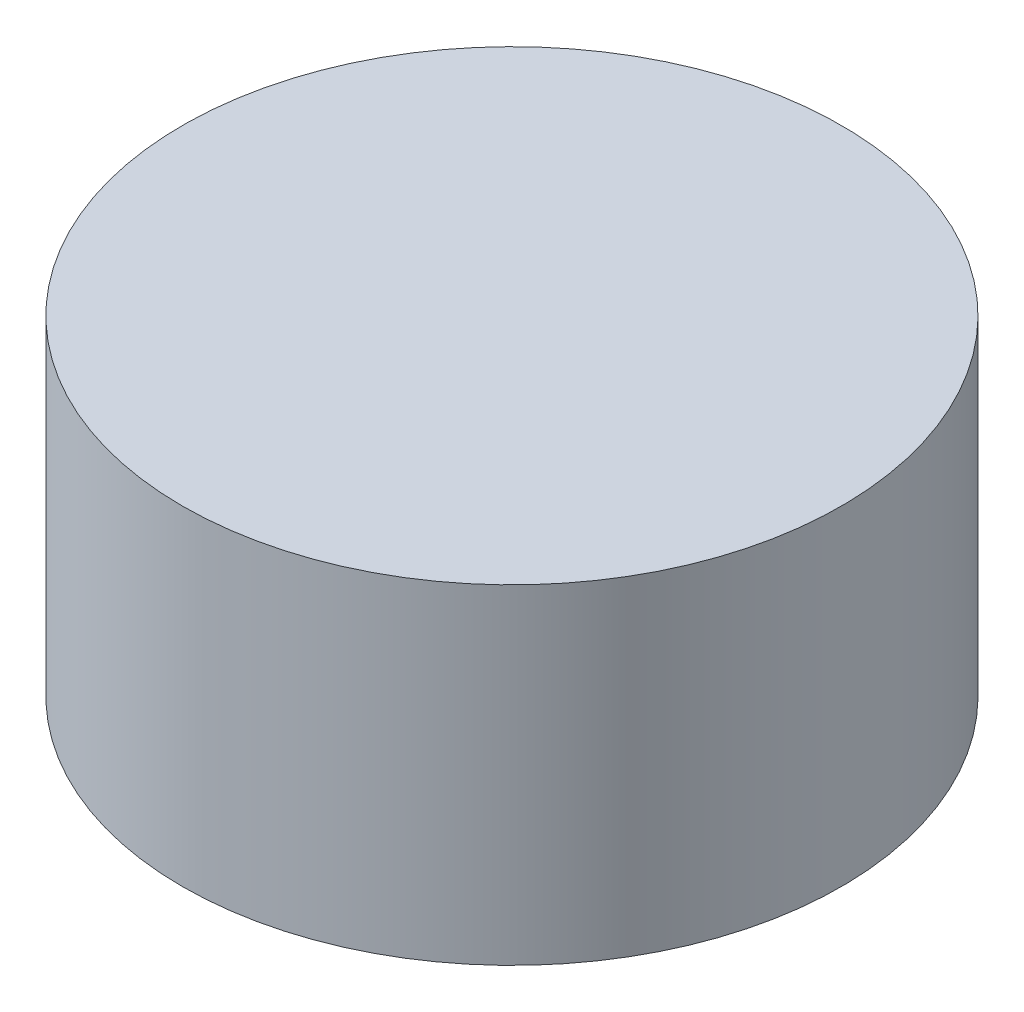
ISO-10303-21;
HEADER;
FILE_DESCRIPTION(('STEP AP214'),'2;1');
FILE_NAME('part.step','',(''),(''),'','','');
FILE_SCHEMA(('AUTOMOTIVE_DESIGN { 1 0 10303 214 1 1 1 1 }'));
ENDSEC;
DATA;
#1=APPLICATION_CONTEXT('core data for automotive mechanical design processes');
#2=APPLICATION_PROTOCOL_DEFINITION('international standard','automotive_design',2000,#1);
#3=PRODUCT_CONTEXT('',#1,'mechanical');
#4=PRODUCT('Part','Part','',(#3));
#5=PRODUCT_RELATED_PRODUCT_CATEGORY('part','',(#4));
#6=PRODUCT_DEFINITION_FORMATION('','',#4);
#7=PRODUCT_DEFINITION_CONTEXT('part definition',#1,'design');
#8=PRODUCT_DEFINITION('design','',#6,#7);
#9=PRODUCT_DEFINITION_SHAPE('','',#8);
#10=(LENGTH_UNIT() NAMED_UNIT(*) SI_UNIT(.MILLI.,.METRE.));
#11=(NAMED_UNIT(*) PLANE_ANGLE_UNIT() SI_UNIT($,.RADIAN.));
#12=(NAMED_UNIT(*) SI_UNIT($,.STERADIAN.) SOLID_ANGLE_UNIT());
#13=UNCERTAINTY_MEASURE_WITH_UNIT(LENGTH_MEASURE(1.E-05),#10,'distance_accuracy_value','');
#14=(GEOMETRIC_REPRESENTATION_CONTEXT(3) GLOBAL_UNCERTAINTY_ASSIGNED_CONTEXT((#13)) GLOBAL_UNIT_ASSIGNED_CONTEXT((#10,
#11,#12)) REPRESENTATION_CONTEXT('',''));
#15=CARTESIAN_POINT('',(0.,0.,0.));
#16=DIRECTION('',(0.,0.,1.));
#17=DIRECTION('',(1.,0.,0.));
#18=AXIS2_PLACEMENT_3D('',#15,#16,#17);
#19=CARTESIAN_POINT('',(0.,8.,0.));
#20=DIRECTION('',(0.,-1.,0.));
#21=DIRECTION('',(0.,0.,-1.));
#22=AXIS2_PLACEMENT_3D('',#19,#20,#21);
#23=CYLINDRICAL_SURFACE('',#22,8.);
#24=CARTESIAN_POINT('',(0.,8.,0.));
#25=DIRECTION('',(0.,1.,0.));
#26=DIRECTION('',(0.,0.,1.));
#27=AXIS2_PLACEMENT_3D('',#24,#25,#26);
#28=CIRCLE('',#27,8.);
#29=CARTESIAN_POINT('',(0.,8.,8.));
#30=VERTEX_POINT('',#29);
#31=EDGE_CURVE('E10',#30,#30,#28,.T.);
#32=ORIENTED_EDGE('',*,*,#31,.F.);
#33=EDGE_LOOP('',(#32));
#34=FACE_BOUND('',#33,.T.);
#35=CARTESIAN_POINT('',(0.,0.,0.));
#36=DIRECTION('',(0.,1.,0.));
#37=DIRECTION('',(0.,0.,1.));
#38=AXIS2_PLACEMENT_3D('',#35,#36,#37);
#39=CIRCLE('',#38,8.);
#40=CARTESIAN_POINT('',(0.,0.,8.));
#41=VERTEX_POINT('',#40);
#42=EDGE_CURVE('E34',#41,#41,#39,.T.);
#43=ORIENTED_EDGE('',*,*,#42,.T.);
#44=EDGE_LOOP('',(#43));
#45=FACE_BOUND('',#44,.T.);
#46=ADVANCED_FACE('F31',(#34,#45),#23,.T.);
#47=CARTESIAN_POINT('',(0.,8.,0.));
#48=DIRECTION('',(0.,1.,0.));
#49=DIRECTION('',(0.,0.,1.));
#50=AXIS2_PLACEMENT_3D('',#47,#48,#49);
#51=PLANE('',#50);
#52=ORIENTED_EDGE('',*,*,#31,.T.);
#53=EDGE_LOOP('',(#52));
#54=FACE_BOUND('',#53,.T.);
#55=ADVANCED_FACE('F46',(#54),#51,.T.);
#56=CARTESIAN_POINT('',(0.,0.,0.));
#57=DIRECTION('',(0.,1.,0.));
#58=DIRECTION('',(0.,0.,1.));
#59=AXIS2_PLACEMENT_3D('',#56,#57,#58);
#60=PLANE('',#59);
#61=ORIENTED_EDGE('',*,*,#42,.F.);
#62=EDGE_LOOP('',(#61));
#63=FACE_BOUND('',#62,.T.);
#64=ADVANCED_FACE('F44',(#63),#60,.F.);
#65=CLOSED_SHELL('',(#46,#55,#64));
#66=MANIFOLD_SOLID_BREP('B2',#65);
#67=ADVANCED_BREP_SHAPE_REPRESENTATION('',(#18,#66),#14);
#68=SHAPE_DEFINITION_REPRESENTATION(#9,#67);
ENDSEC;
END-ISO-10303-21;
